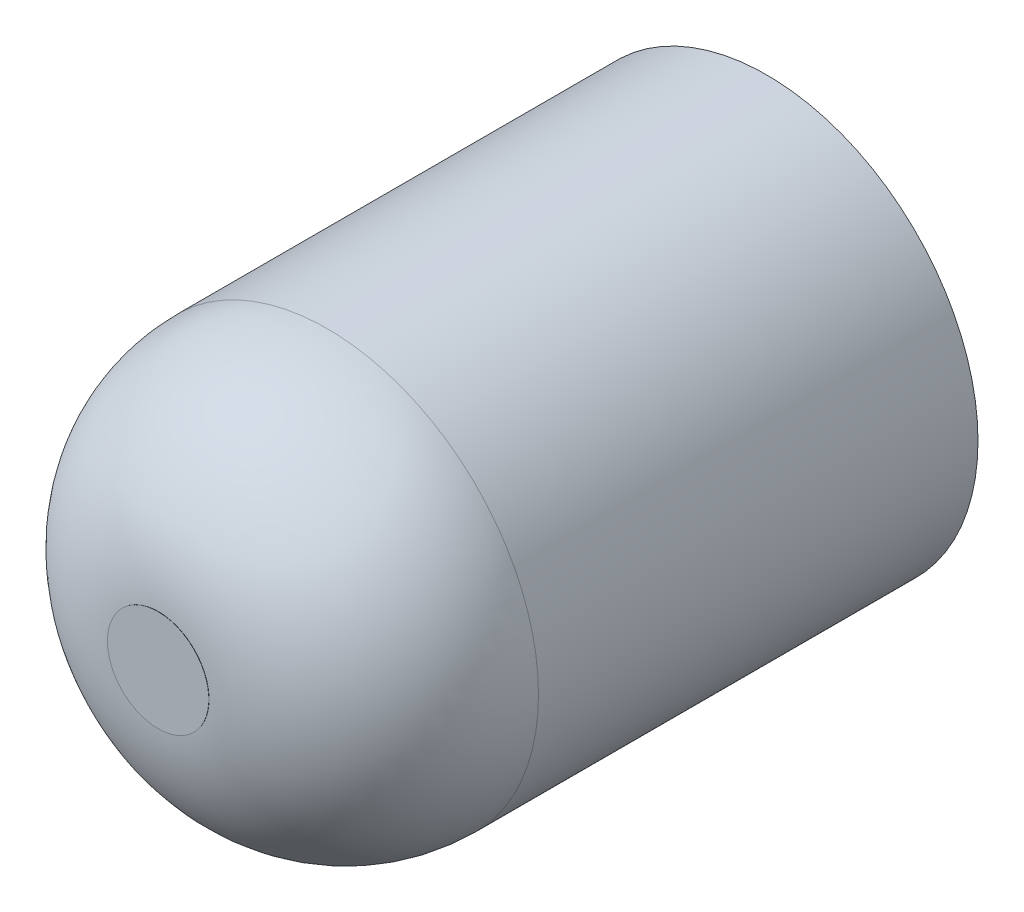
ISO-10303-21;
HEADER;
FILE_DESCRIPTION(('STEP AP214'),'2;1');
FILE_NAME('part.step','',(''),(''),'','','');
FILE_SCHEMA(('AUTOMOTIVE_DESIGN { 1 0 10303 214 1 1 1 1 }'));
ENDSEC;
DATA;
#1=APPLICATION_CONTEXT('core data for automotive mechanical design processes');
#2=APPLICATION_PROTOCOL_DEFINITION('international standard','automotive_design',2000,#1);
#3=PRODUCT_CONTEXT('',#1,'mechanical');
#4=PRODUCT('Part','Part','',(#3));
#5=PRODUCT_RELATED_PRODUCT_CATEGORY('part','',(#4));
#6=PRODUCT_DEFINITION_FORMATION('','',#4);
#7=PRODUCT_DEFINITION_CONTEXT('part definition',#1,'design');
#8=PRODUCT_DEFINITION('design','',#6,#7);
#9=PRODUCT_DEFINITION_SHAPE('','',#8);
#10=(LENGTH_UNIT() NAMED_UNIT(*) SI_UNIT(.MILLI.,.METRE.));
#11=(NAMED_UNIT(*) PLANE_ANGLE_UNIT() SI_UNIT($,.RADIAN.));
#12=(NAMED_UNIT(*) SI_UNIT($,.STERADIAN.) SOLID_ANGLE_UNIT());
#13=UNCERTAINTY_MEASURE_WITH_UNIT(LENGTH_MEASURE(1.E-05),#10,'distance_accuracy_value','');
#14=(GEOMETRIC_REPRESENTATION_CONTEXT(3) GLOBAL_UNCERTAINTY_ASSIGNED_CONTEXT((#13)) GLOBAL_UNIT_ASSIGNED_CONTEXT((#10,
#11,#12)) REPRESENTATION_CONTEXT('',''));
#15=CARTESIAN_POINT('',(0.,0.,0.));
#16=DIRECTION('',(0.,0.,1.));
#17=DIRECTION('',(1.,0.,0.));
#18=AXIS2_PLACEMENT_3D('',#15,#16,#17);
#19=CARTESIAN_POINT('',(0.,0.,-16.));
#20=DIRECTION('',(0.,0.,1.));
#21=DIRECTION('',(1.,0.,0.));
#22=AXIS2_PLACEMENT_3D('',#19,#20,#21);
#23=CYLINDRICAL_SURFACE('',#22,12.5);
#24=CARTESIAN_POINT('',(0.,0.,-6.));
#25=DIRECTION('',(0.,0.,-1.));
#26=DIRECTION('',(-1.,0.,0.));
#27=AXIS2_PLACEMENT_3D('',#24,#25,#26);
#28=CIRCLE('',#27,12.5);
#29=CARTESIAN_POINT('',(-12.5,0.,-6.));
#30=VERTEX_POINT('',#29);
#31=EDGE_CURVE('E12',#30,#30,#28,.F.);
#32=ORIENTED_EDGE('',*,*,#31,.T.);
#33=EDGE_LOOP('',(#32));
#34=FACE_BOUND('',#33,.T.);
#35=CARTESIAN_POINT('',(0.,0.,0.));
#36=DIRECTION('',(0.,0.,-1.));
#37=DIRECTION('',(-1.,0.,0.));
#38=AXIS2_PLACEMENT_3D('',#35,#36,#37);
#39=CIRCLE('',#38,12.5);
#40=CARTESIAN_POINT('',(-12.5,0.,0.));
#41=VERTEX_POINT('',#40);
#42=EDGE_CURVE('E55',#41,#41,#39,.T.);
#43=ORIENTED_EDGE('',*,*,#42,.T.);
#44=EDGE_LOOP('',(#43));
#45=FACE_BOUND('',#44,.T.);
#46=ADVANCED_FACE('F47',(#34,#45),#23,.T.);
#47=CARTESIAN_POINT('',(0.,0.,0.));
#48=DIRECTION('',(0.,0.,-1.));
#49=DIRECTION('',(-1.,0.,0.));
#50=AXIS2_PLACEMENT_3D('',#47,#48,#49);
#51=PLANE('',#50);
#52=CARTESIAN_POINT('',(0.,0.,0.));
#53=DIRECTION('',(0.,0.,1.));
#54=DIRECTION('',(1.,0.,0.));
#55=AXIS2_PLACEMENT_3D('',#52,#53,#54);
#56=CIRCLE('',#55,3.);
#57=CARTESIAN_POINT('',(3.,0.,0.));
#58=VERTEX_POINT('',#57);
#59=EDGE_CURVE('E61',#58,#58,#56,.T.);
#60=ORIENTED_EDGE('',*,*,#59,.F.);
#61=EDGE_LOOP('',(#60));
#62=FACE_BOUND('',#61,.T.);
#63=ORIENTED_EDGE('',*,*,#42,.F.);
#64=EDGE_LOOP('',(#63));
#65=FACE_BOUND('',#64,.T.);
#66=ADVANCED_FACE('F72',(#62,#65),#51,.F.);
#67=CARTESIAN_POINT('',(0.,0.,-6.));
#68=DIRECTION('',(0.,0.,-1.));
#69=DIRECTION('',(-1.,0.,0.));
#70=AXIS2_PLACEMENT_3D('',#67,#68,#69);
#71=DEGENERATE_TOROIDAL_SURFACE('',#70,2.5,10.,.T.);
#72=CARTESIAN_POINT('',(0.,0.,-15.9874921777191));
#73=DIRECTION('',(0.,0.,1.));
#74=DIRECTION('',(1.,0.,0.));
#75=AXIS2_PLACEMENT_3D('',#72,#73,#74);
#76=CIRCLE('',#75,3.);
#77=CARTESIAN_POINT('',(3.,0.,-15.9874921777191));
#78=VERTEX_POINT('',#77);
#79=EDGE_CURVE('E51',#78,#78,#76,.F.);
#80=ORIENTED_EDGE('',*,*,#79,.F.);
#81=EDGE_LOOP('',(#80));
#82=FACE_BOUND('',#81,.T.);
#83=ORIENTED_EDGE('',*,*,#31,.F.);
#84=EDGE_LOOP('',(#83));
#85=FACE_BOUND('',#84,.T.);
#86=ADVANCED_FACE('F49',(#82,#85),#71,.T.);
#87=CARTESIAN_POINT('',(0.,0.,-20.));
#88=DIRECTION('',(0.,0.,1.));
#89=DIRECTION('',(1.,0.,0.));
#90=AXIS2_PLACEMENT_3D('',#87,#88,#89);
#91=CYLINDRICAL_SURFACE('',#90,3.);
#92=ORIENTED_EDGE('',*,*,#79,.T.);
#93=EDGE_LOOP('',(#92));
#94=FACE_BOUND('',#93,.T.);
#95=ORIENTED_EDGE('',*,*,#59,.T.);
#96=EDGE_LOOP('',(#95));
#97=FACE_BOUND('',#96,.T.);
#98=ADVANCED_FACE('F68',(#94,#97),#91,.F.);
#99=CLOSED_SHELL('',(#46,#66,#86,#98));
#100=MANIFOLD_SOLID_BREP('B2_NOT_SHOWN',#99);
#101=CARTESIAN_POINT('',(0.,0.,22.));
#102=DIRECTION('',(0.,0.,-1.));
#103=DIRECTION('',(-1.,0.,0.));
#104=AXIS2_PLACEMENT_3D('',#101,#102,#103);
#105=CYLINDRICAL_SURFACE('',#104,3.);
#106=CARTESIAN_POINT('',(0.,0.,-14.));
#107=DIRECTION('',(0.,0.,-1.));
#108=DIRECTION('',(-1.,0.,0.));
#109=AXIS2_PLACEMENT_3D('',#106,#107,#108);
#110=CIRCLE('',#109,3.);
#111=CARTESIAN_POINT('',(-3.,0.,-14.));
#112=VERTEX_POINT('',#111);
#113=EDGE_CURVE('E46',#112,#112,#110,.T.);
#114=ORIENTED_EDGE('',*,*,#113,.T.);
#115=EDGE_LOOP('',(#114));
#116=FACE_BOUND('',#115,.T.);
#117=CARTESIAN_POINT('',(0.,0.,-16.));
#118=DIRECTION('',(0.,0.,-1.));
#119=DIRECTION('',(-1.,0.,0.));
#120=AXIS2_PLACEMENT_3D('',#117,#118,#119);
#121=CIRCLE('',#120,3.);
#122=CARTESIAN_POINT('',(-3.,0.,-16.));
#123=VERTEX_POINT('',#122);
#124=EDGE_CURVE('E133',#123,#123,#121,.T.);
#125=ORIENTED_EDGE('',*,*,#124,.F.);
#126=EDGE_LOOP('',(#125));
#127=FACE_BOUND('',#126,.T.);
#128=ADVANCED_FACE('F109',(#116,#127),#105,.T.);
#129=CARTESIAN_POINT('',(0.,0.,-16.));
#130=DIRECTION('',(0.,0.,-1.));
#131=DIRECTION('',(-1.,0.,0.));
#132=AXIS2_PLACEMENT_3D('',#129,#130,#131);
#133=PLANE('',#132);
#134=ORIENTED_EDGE('',*,*,#124,.T.);
#135=EDGE_LOOP('',(#134));
#136=FACE_BOUND('',#135,.T.);
#137=ADVANCED_FACE('F140',(#136),#133,.T.);
#138=CARTESIAN_POINT('',(0.,0.,-14.));
#139=DIRECTION('',(0.,0.,1.));
#140=DIRECTION('',(1.,0.,0.));
#141=AXIS2_PLACEMENT_3D('',#138,#139,#140);
#142=CYLINDRICAL_SURFACE('',#141,12.5);
#143=CARTESIAN_POINT('',(0.,0.,-14.));
#144=DIRECTION('',(0.,0.,-1.));
#145=DIRECTION('',(-1.,0.,0.));
#146=AXIS2_PLACEMENT_3D('',#143,#144,#145);
#147=CIRCLE('',#146,12.5);
#148=CARTESIAN_POINT('',(-12.5,0.,-14.));
#149=VERTEX_POINT('',#148);
#150=EDGE_CURVE('E113',#149,#149,#147,.T.);
#151=ORIENTED_EDGE('',*,*,#150,.F.);
#152=EDGE_LOOP('',(#151));
#153=FACE_BOUND('',#152,.T.);
#154=CARTESIAN_POINT('',(0.,0.,12.));
#155=DIRECTION('',(0.,0.,-1.));
#156=DIRECTION('',(-1.,0.,0.));
#157=AXIS2_PLACEMENT_3D('',#154,#155,#156);
#158=CIRCLE('',#157,12.5);
#159=CARTESIAN_POINT('',(-12.5,0.,12.));
#160=VERTEX_POINT('',#159);
#161=EDGE_CURVE('E121',#160,#160,#158,.F.);
#162=ORIENTED_EDGE('',*,*,#161,.F.);
#163=EDGE_LOOP('',(#162));
#164=FACE_BOUND('',#163,.T.);
#165=ADVANCED_FACE('F111',(#153,#164),#142,.T.);
#166=CARTESIAN_POINT('',(0.,0.,-14.));
#167=DIRECTION('',(0.,0.,-1.));
#168=DIRECTION('',(-1.,0.,0.));
#169=AXIS2_PLACEMENT_3D('',#166,#167,#168);
#170=PLANE('',#169);
#171=ORIENTED_EDGE('',*,*,#113,.F.);
#172=EDGE_LOOP('',(#171));
#173=FACE_BOUND('',#172,.T.);
#174=ORIENTED_EDGE('',*,*,#150,.T.);
#175=EDGE_LOOP('',(#174));
#176=FACE_BOUND('',#175,.T.);
#177=ADVANCED_FACE('F161',(#173,#176),#170,.T.);
#178=CARTESIAN_POINT('',(0.,0.,12.));
#179=DIRECTION('',(0.,0.,1.));
#180=DIRECTION('',(-1.,0.,0.));
#181=AXIS2_PLACEMENT_3D('',#178,#179,#180);
#182=DEGENERATE_TOROIDAL_SURFACE('',#181,2.5,10.,.T.);
#183=CARTESIAN_POINT('',(0.,0.,21.9874921777191));
#184=DIRECTION('',(0.,0.,-1.));
#185=DIRECTION('',(-1.,0.,0.));
#186=AXIS2_PLACEMENT_3D('',#183,#184,#185);
#187=CIRCLE('',#186,3.);
#188=CARTESIAN_POINT('',(-3.,0.,21.9874921777191));
#189=VERTEX_POINT('',#188);
#190=EDGE_CURVE('E123',#189,#189,#187,.F.);
#191=ORIENTED_EDGE('',*,*,#190,.F.);
#192=EDGE_LOOP('',(#191));
#193=FACE_BOUND('',#192,.T.);
#194=ORIENTED_EDGE('',*,*,#161,.T.);
#195=EDGE_LOOP('',(#194));
#196=FACE_BOUND('',#195,.T.);
#197=ADVANCED_FACE('F156',(#193,#196),#182,.T.);
#198=CARTESIAN_POINT('',(0.,0.,22.));
#199=DIRECTION('',(0.,0.,-1.));
#200=DIRECTION('',(-1.,0.,0.));
#201=AXIS2_PLACEMENT_3D('',#198,#199,#200);
#202=PLANE('',#201);
#203=CARTESIAN_POINT('',(0.,0.,22.));
#204=DIRECTION('',(0.,0.,-1.));
#205=DIRECTION('',(-1.,0.,0.));
#206=AXIS2_PLACEMENT_3D('',#203,#204,#205);
#207=CIRCLE('',#206,3.);
#208=CARTESIAN_POINT('',(-3.,0.,22.));
#209=VERTEX_POINT('',#208);
#210=EDGE_CURVE('E129',#209,#209,#207,.T.);
#211=ORIENTED_EDGE('',*,*,#210,.F.);
#212=EDGE_LOOP('',(#211));
#213=FACE_BOUND('',#212,.T.);
#214=ADVANCED_FACE('F152',(#213),#202,.F.);
#215=ORIENTED_EDGE('',*,*,#190,.T.);
#216=EDGE_LOOP('',(#215));
#217=FACE_BOUND('',#216,.T.);
#218=ORIENTED_EDGE('',*,*,#210,.T.);
#219=EDGE_LOOP('',(#218));
#220=FACE_BOUND('',#219,.T.);
#221=ADVANCED_FACE('F144',(#217,#220),#105,.T.);
#222=CLOSED_SHELL('',(#128,#137,#165,#177,#197,#214,#221));
#223=MANIFOLD_SOLID_BREP('B7',#222);
#224=ADVANCED_BREP_SHAPE_REPRESENTATION('',(#18,#100,#223),#14);
#225=SHAPE_DEFINITION_REPRESENTATION(#9,#224);
ENDSEC;
END-ISO-10303-21;
